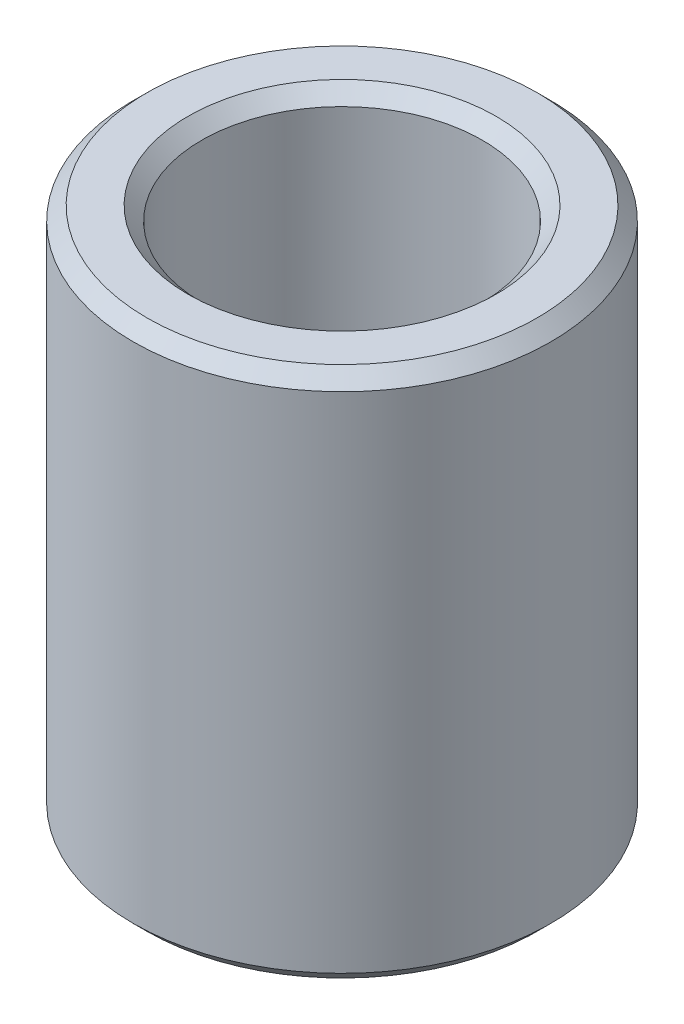
ISO-10303-21;
HEADER;
FILE_DESCRIPTION(('STEP AP214'),'2;1');
FILE_NAME('part.step','',(''),(''),'','','');
FILE_SCHEMA(('AUTOMOTIVE_DESIGN { 1 0 10303 214 1 1 1 1 }'));
ENDSEC;
DATA;
#1=APPLICATION_CONTEXT('core data for automotive mechanical design processes');
#2=APPLICATION_PROTOCOL_DEFINITION('international standard','automotive_design',2000,#1);
#3=PRODUCT_CONTEXT('',#1,'mechanical');
#4=PRODUCT('Part','Part','',(#3));
#5=PRODUCT_RELATED_PRODUCT_CATEGORY('part','',(#4));
#6=PRODUCT_DEFINITION_FORMATION('','',#4);
#7=PRODUCT_DEFINITION_CONTEXT('part definition',#1,'design');
#8=PRODUCT_DEFINITION('design','',#6,#7);
#9=PRODUCT_DEFINITION_SHAPE('','',#8);
#10=(LENGTH_UNIT() NAMED_UNIT(*) SI_UNIT(.MILLI.,.METRE.));
#11=(NAMED_UNIT(*) PLANE_ANGLE_UNIT() SI_UNIT($,.RADIAN.));
#12=(NAMED_UNIT(*) SI_UNIT($,.STERADIAN.) SOLID_ANGLE_UNIT());
#13=UNCERTAINTY_MEASURE_WITH_UNIT(LENGTH_MEASURE(1.E-05),#10,'distance_accuracy_value','');
#14=(GEOMETRIC_REPRESENTATION_CONTEXT(3) GLOBAL_UNCERTAINTY_ASSIGNED_CONTEXT((#13)) GLOBAL_UNIT_ASSIGNED_CONTEXT((#10,
#11,#12)) REPRESENTATION_CONTEXT('',''));
#15=CARTESIAN_POINT('',(0.,0.,0.));
#16=DIRECTION('',(0.,0.,1.));
#17=DIRECTION('',(1.,0.,0.));
#18=AXIS2_PLACEMENT_3D('',#15,#16,#17);
#19=CARTESIAN_POINT('',(0.,25.4323578760837,0.));
#20=DIRECTION('',(0.,-1.,0.));
#21=DIRECTION('',(0.,0.,-1.));
#22=AXIS2_PLACEMENT_3D('',#19,#20,#21);
#23=CYLINDRICAL_SURFACE('',#22,10.);
#24=CARTESIAN_POINT('',(0.,0.659512166050986,0.));
#25=DIRECTION('',(0.,1.,0.));
#26=DIRECTION('',(0.,0.,1.));
#27=AXIS2_PLACEMENT_3D('',#24,#25,#26);
#28=CIRCLE('',#27,10.);
#29=CARTESIAN_POINT('',(0.,0.659512166050986,10.));
#30=VERTEX_POINT('',#29);
#31=EDGE_CURVE('E10',#30,#30,#28,.T.);
#32=ORIENTED_EDGE('',*,*,#31,.T.);
#33=EDGE_LOOP('',(#32));
#34=FACE_BOUND('',#33,.T.);
#35=CARTESIAN_POINT('',(0.,24.7728457100327,0.));
#36=DIRECTION('',(0.,1.,0.));
#37=DIRECTION('',(0.,0.,1.));
#38=AXIS2_PLACEMENT_3D('',#35,#36,#37);
#39=CIRCLE('',#38,10.);
#40=CARTESIAN_POINT('',(0.,24.7728457100327,10.));
#41=VERTEX_POINT('',#40);
#42=EDGE_CURVE('E50',#41,#41,#39,.F.);
#43=ORIENTED_EDGE('',*,*,#42,.T.);
#44=EDGE_LOOP('',(#43));
#45=FACE_BOUND('',#44,.T.);
#46=ADVANCED_FACE('F39',(#34,#45),#23,.T.);
#47=CARTESIAN_POINT('',(0.,25.4323578760837,0.));
#48=DIRECTION('',(0.,1.,0.));
#49=DIRECTION('',(0.,0.,1.));
#50=AXIS2_PLACEMENT_3D('',#47,#48,#49);
#51=PLANE('',#50);
#52=CARTESIAN_POINT('',(0.,25.4323578760837,0.));
#53=DIRECTION('',(0.,1.,0.));
#54=DIRECTION('',(0.,0.,1.));
#55=AXIS2_PLACEMENT_3D('',#52,#53,#54);
#56=CIRCLE('',#55,7.3785935040275);
#57=CARTESIAN_POINT('',(0.,25.4323578760837,7.3785935040275));
#58=VERTEX_POINT('',#57);
#59=EDGE_CURVE('E58',#58,#58,#56,.F.);
#60=ORIENTED_EDGE('',*,*,#59,.T.);
#61=EDGE_LOOP('',(#60));
#62=FACE_BOUND('',#61,.T.);
#63=CARTESIAN_POINT('',(0.,25.4323578760837,0.));
#64=DIRECTION('',(0.,1.,0.));
#65=DIRECTION('',(0.,0.,1.));
#66=AXIS2_PLACEMENT_3D('',#63,#64,#65);
#67=CIRCLE('',#66,9.34048783394902);
#68=CARTESIAN_POINT('',(0.,25.4323578760837,9.34048783394902));
#69=VERTEX_POINT('',#68);
#70=EDGE_CURVE('E61',#69,#69,#67,.T.);
#71=ORIENTED_EDGE('',*,*,#70,.T.);
#72=EDGE_LOOP('',(#71));
#73=FACE_BOUND('',#72,.T.);
#74=ADVANCED_FACE('F88',(#62,#73),#51,.T.);
#75=CARTESIAN_POINT('',(0.,0.,0.));
#76=DIRECTION('',(0.,1.,0.));
#77=DIRECTION('',(0.,0.,1.));
#78=AXIS2_PLACEMENT_3D('',#75,#76,#77);
#79=PLANE('',#78);
#80=CARTESIAN_POINT('',(0.,0.,0.));
#81=DIRECTION('',(0.,1.,0.));
#82=DIRECTION('',(0.,0.,1.));
#83=AXIS2_PLACEMENT_3D('',#80,#81,#82);
#84=CIRCLE('',#83,7.37859350402748);
#85=CARTESIAN_POINT('',(0.,0.,7.37859350402748));
#86=VERTEX_POINT('',#85);
#87=EDGE_CURVE('E51',#86,#86,#84,.T.);
#88=ORIENTED_EDGE('',*,*,#87,.T.);
#89=EDGE_LOOP('',(#88));
#90=FACE_BOUND('',#89,.T.);
#91=CARTESIAN_POINT('',(0.,0.,0.));
#92=DIRECTION('',(0.,1.,0.));
#93=DIRECTION('',(0.,0.,1.));
#94=AXIS2_PLACEMENT_3D('',#91,#92,#93);
#95=CIRCLE('',#94,9.34048783394901);
#96=CARTESIAN_POINT('',(0.,0.,9.34048783394901));
#97=VERTEX_POINT('',#96);
#98=EDGE_CURVE('E54',#97,#97,#95,.F.);
#99=ORIENTED_EDGE('',*,*,#98,.T.);
#100=EDGE_LOOP('',(#99));
#101=FACE_BOUND('',#100,.T.);
#102=ADVANCED_FACE('F83',(#90,#101),#79,.F.);
#103=CARTESIAN_POINT('',(0.,25.4323578760837,0.));
#104=DIRECTION('',(0.,-1.,0.));
#105=DIRECTION('',(0.,0.,-1.));
#106=AXIS2_PLACEMENT_3D('',#103,#104,#105);
#107=CYLINDRICAL_SURFACE('',#106,6.71908133797649);
#108=CARTESIAN_POINT('',(0.,24.7728457100327,0.));
#109=DIRECTION('',(0.,1.,0.));
#110=DIRECTION('',(0.,0.,1.));
#111=AXIS2_PLACEMENT_3D('',#108,#109,#110);
#112=CIRCLE('',#111,6.71908133797649);
#113=CARTESIAN_POINT('',(0.,24.7728457100327,6.71908133797649));
#114=VERTEX_POINT('',#113);
#115=EDGE_CURVE('E67',#114,#114,#112,.T.);
#116=ORIENTED_EDGE('',*,*,#115,.T.);
#117=EDGE_LOOP('',(#116));
#118=FACE_BOUND('',#117,.T.);
#119=CARTESIAN_POINT('',(0.,0.659512166050997,0.));
#120=DIRECTION('',(0.,1.,0.));
#121=DIRECTION('',(0.,0.,1.));
#122=AXIS2_PLACEMENT_3D('',#119,#120,#121);
#123=CIRCLE('',#122,6.71908133797649);
#124=CARTESIAN_POINT('',(0.,0.659512166050997,6.71908133797649));
#125=VERTEX_POINT('',#124);
#126=EDGE_CURVE('E69',#125,#125,#123,.F.);
#127=ORIENTED_EDGE('',*,*,#126,.T.);
#128=EDGE_LOOP('',(#127));
#129=FACE_BOUND('',#128,.T.);
#130=ADVANCED_FACE('F71',(#118,#129),#107,.F.);
#131=CARTESIAN_POINT('',(0.,24.7728457100327,0.));
#132=DIRECTION('',(0.,1.,0.));
#133=DIRECTION('',(0.,0.,1.));
#134=AXIS2_PLACEMENT_3D('',#131,#132,#133);
#135=CONICAL_SURFACE('',#134,6.71908133797649,0.785398163397458);
#136=ORIENTED_EDGE('',*,*,#59,.F.);
#137=EDGE_LOOP('',(#136));
#138=FACE_BOUND('',#137,.T.);
#139=ORIENTED_EDGE('',*,*,#115,.F.);
#140=EDGE_LOOP('',(#139));
#141=FACE_BOUND('',#140,.T.);
#142=ADVANCED_FACE('F77',(#138,#141),#135,.F.);
#143=CARTESIAN_POINT('',(0.,0.,0.));
#144=DIRECTION('',(0.,-1.,0.));
#145=DIRECTION('',(0.,0.,-1.));
#146=AXIS2_PLACEMENT_3D('',#143,#144,#145);
#147=CONICAL_SURFACE('',#146,7.37859350402748,0.785398163397444);
#148=ORIENTED_EDGE('',*,*,#126,.F.);
#149=EDGE_LOOP('',(#148));
#150=FACE_BOUND('',#149,.T.);
#151=ORIENTED_EDGE('',*,*,#87,.F.);
#152=EDGE_LOOP('',(#151));
#153=FACE_BOUND('',#152,.T.);
#154=ADVANCED_FACE('F73',(#150,#153),#147,.F.);
#155=CARTESIAN_POINT('',(0.,0.659512166050986,0.));
#156=DIRECTION('',(0.,1.,0.));
#157=DIRECTION('',(0.,0.,1.));
#158=AXIS2_PLACEMENT_3D('',#155,#156,#157);
#159=CONICAL_SURFACE('',#158,10.,0.785398163397454);
#160=ORIENTED_EDGE('',*,*,#98,.F.);
#161=EDGE_LOOP('',(#160));
#162=FACE_BOUND('',#161,.T.);
#163=ORIENTED_EDGE('',*,*,#31,.F.);
#164=EDGE_LOOP('',(#163));
#165=FACE_BOUND('',#164,.T.);
#166=ADVANCED_FACE('F76',(#162,#165),#159,.T.);
#167=CARTESIAN_POINT('',(0.,25.4323578760837,0.));
#168=DIRECTION('',(0.,-1.,0.));
#169=DIRECTION('',(0.,0.,-1.));
#170=AXIS2_PLACEMENT_3D('',#167,#168,#169);
#171=CONICAL_SURFACE('',#170,9.34048783394902,0.785398163397446);
#172=ORIENTED_EDGE('',*,*,#42,.F.);
#173=EDGE_LOOP('',(#172));
#174=FACE_BOUND('',#173,.T.);
#175=ORIENTED_EDGE('',*,*,#70,.F.);
#176=EDGE_LOOP('',(#175));
#177=FACE_BOUND('',#176,.T.);
#178=ADVANCED_FACE('F45',(#174,#177),#171,.T.);
#179=CLOSED_SHELL('',(#46,#74,#102,#130,#142,#154,#166,#178));
#180=MANIFOLD_SOLID_BREP('B2',#179);
#181=ADVANCED_BREP_SHAPE_REPRESENTATION('',(#18,#180),#14);
#182=SHAPE_DEFINITION_REPRESENTATION(#9,#181);
ENDSEC;
END-ISO-10303-21;
